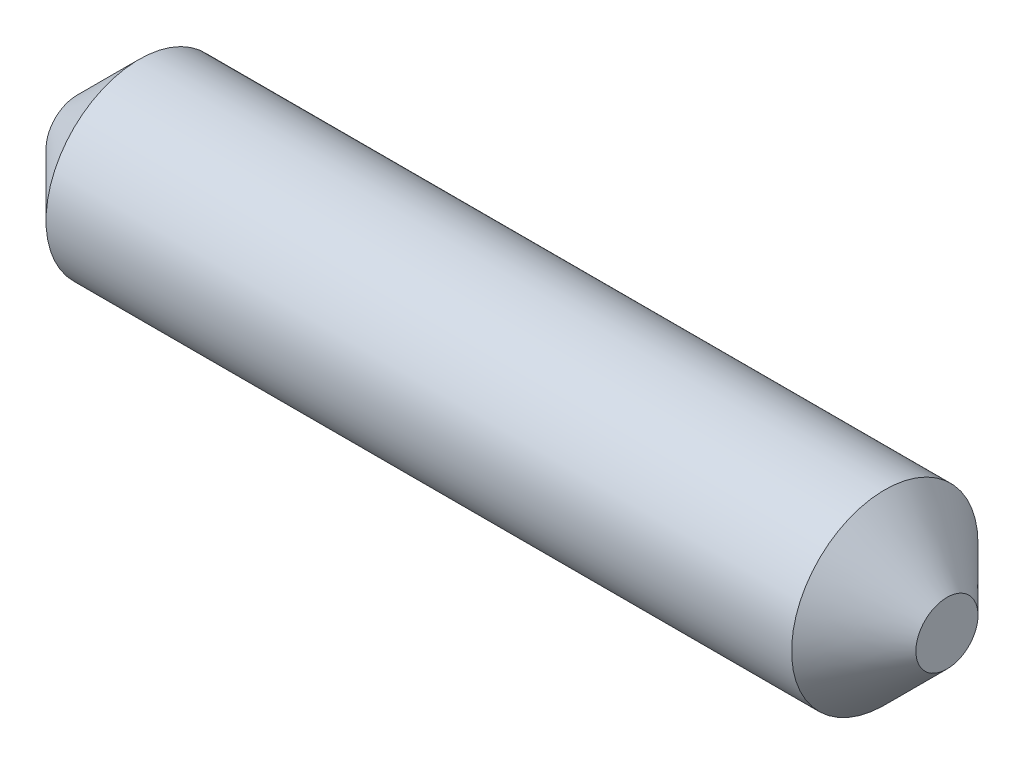
ISO-10303-21;
HEADER;
FILE_DESCRIPTION(('STEP AP214'),'2;1');
FILE_NAME('part.step','',(''),(''),'','','');
FILE_SCHEMA(('AUTOMOTIVE_DESIGN { 1 0 10303 214 1 1 1 1 }'));
ENDSEC;
DATA;
#1=APPLICATION_CONTEXT('core data for automotive mechanical design processes');
#2=APPLICATION_PROTOCOL_DEFINITION('international standard','automotive_design',2000,#1);
#3=PRODUCT_CONTEXT('',#1,'mechanical');
#4=PRODUCT('Part','Part','',(#3));
#5=PRODUCT_RELATED_PRODUCT_CATEGORY('part','',(#4));
#6=PRODUCT_DEFINITION_FORMATION('','',#4);
#7=PRODUCT_DEFINITION_CONTEXT('part definition',#1,'design');
#8=PRODUCT_DEFINITION('design','',#6,#7);
#9=PRODUCT_DEFINITION_SHAPE('','',#8);
#10=(LENGTH_UNIT() NAMED_UNIT(*) SI_UNIT(.MILLI.,.METRE.));
#11=(NAMED_UNIT(*) PLANE_ANGLE_UNIT() SI_UNIT($,.RADIAN.));
#12=(NAMED_UNIT(*) SI_UNIT($,.STERADIAN.) SOLID_ANGLE_UNIT());
#13=UNCERTAINTY_MEASURE_WITH_UNIT(LENGTH_MEASURE(1.E-05),#10,'distance_accuracy_value','');
#14=(GEOMETRIC_REPRESENTATION_CONTEXT(3) GLOBAL_UNCERTAINTY_ASSIGNED_CONTEXT((#13)) GLOBAL_UNIT_ASSIGNED_CONTEXT((#10,
#11,#12)) REPRESENTATION_CONTEXT('',''));
#15=CARTESIAN_POINT('',(0.,0.,0.));
#16=DIRECTION('',(0.,0.,1.));
#17=DIRECTION('',(1.,0.,0.));
#18=AXIS2_PLACEMENT_3D('',#15,#16,#17);
#19=CARTESIAN_POINT('',(7.,0.,0.));
#20=DIRECTION('',(-1.,0.,0.));
#21=DIRECTION('',(0.,0.,1.));
#22=AXIS2_PLACEMENT_3D('',#19,#20,#21);
#23=CYLINDRICAL_SURFACE('',#22,1.5);
#24=CARTESIAN_POINT('',(-6.,0.,0.));
#25=DIRECTION('',(1.,0.,0.));
#26=DIRECTION('',(0.,0.,-1.));
#27=AXIS2_PLACEMENT_3D('',#24,#25,#26);
#28=CIRCLE('',#27,1.5);
#29=CARTESIAN_POINT('',(-6.,0.,-1.5));
#30=VERTEX_POINT('',#29);
#31=EDGE_CURVE('E42',#30,#30,#28,.T.);
#32=ORIENTED_EDGE('',*,*,#31,.T.);
#33=EDGE_LOOP('',(#32));
#34=FACE_BOUND('',#33,.T.);
#35=CARTESIAN_POINT('',(5.99999999999999,0.,0.));
#36=DIRECTION('',(1.,0.,0.));
#37=DIRECTION('',(0.,0.,-1.));
#38=AXIS2_PLACEMENT_3D('',#35,#36,#37);
#39=CIRCLE('',#38,1.5);
#40=CARTESIAN_POINT('',(5.99999999999999,0.,-1.5));
#41=VERTEX_POINT('',#40);
#42=EDGE_CURVE('E46',#41,#41,#39,.F.);
#43=ORIENTED_EDGE('',*,*,#42,.T.);
#44=EDGE_LOOP('',(#43));
#45=FACE_BOUND('',#44,.T.);
#46=ADVANCED_FACE('F31',(#34,#45),#23,.T.);
#47=CARTESIAN_POINT('',(7.,0.,0.));
#48=DIRECTION('',(1.,0.,0.));
#49=DIRECTION('',(0.,0.,-1.));
#50=AXIS2_PLACEMENT_3D('',#47,#48,#49);
#51=PLANE('',#50);
#52=CARTESIAN_POINT('',(7.,0.,0.));
#53=DIRECTION('',(1.,0.,0.));
#54=DIRECTION('',(0.,0.,-1.));
#55=AXIS2_PLACEMENT_3D('',#52,#53,#54);
#56=CIRCLE('',#55,0.499999999999997);
#57=CARTESIAN_POINT('',(7.,0.,-0.499999999999997));
#58=VERTEX_POINT('',#57);
#59=EDGE_CURVE('E10',#58,#58,#56,.T.);
#60=ORIENTED_EDGE('',*,*,#59,.T.);
#61=EDGE_LOOP('',(#60));
#62=FACE_BOUND('',#61,.T.);
#63=ADVANCED_FACE('F62',(#62),#51,.T.);
#64=CARTESIAN_POINT('',(-7.,0.,0.));
#65=DIRECTION('',(1.,0.,0.));
#66=DIRECTION('',(0.,0.,-1.));
#67=AXIS2_PLACEMENT_3D('',#64,#65,#66);
#68=PLANE('',#67);
#69=CARTESIAN_POINT('',(-7.,0.,0.));
#70=DIRECTION('',(1.,0.,0.));
#71=DIRECTION('',(0.,0.,-1.));
#72=AXIS2_PLACEMENT_3D('',#69,#70,#71);
#73=CIRCLE('',#72,0.5);
#74=CARTESIAN_POINT('',(-7.,0.,-0.5));
#75=VERTEX_POINT('',#74);
#76=EDGE_CURVE('E38',#75,#75,#73,.F.);
#77=ORIENTED_EDGE('',*,*,#76,.T.);
#78=EDGE_LOOP('',(#77));
#79=FACE_BOUND('',#78,.T.);
#80=ADVANCED_FACE('F59',(#79),#68,.F.);
#81=CARTESIAN_POINT('',(-6.,0.,0.));
#82=DIRECTION('',(1.,0.,0.));
#83=DIRECTION('',(0.,0.,-1.));
#84=AXIS2_PLACEMENT_3D('',#81,#82,#83);
#85=CONICAL_SURFACE('',#84,1.5,0.78539816339745);
#86=ORIENTED_EDGE('',*,*,#76,.F.);
#87=EDGE_LOOP('',(#86));
#88=FACE_BOUND('',#87,.T.);
#89=ORIENTED_EDGE('',*,*,#31,.F.);
#90=EDGE_LOOP('',(#89));
#91=FACE_BOUND('',#90,.T.);
#92=ADVANCED_FACE('F55',(#88,#91),#85,.T.);
#93=CARTESIAN_POINT('',(7.,0.,0.));
#94=DIRECTION('',(-1.,0.,0.));
#95=DIRECTION('',(0.,0.,1.));
#96=AXIS2_PLACEMENT_3D('',#93,#94,#95);
#97=CONICAL_SURFACE('',#96,0.499999999999997,0.785398163397447);
#98=ORIENTED_EDGE('',*,*,#42,.F.);
#99=EDGE_LOOP('',(#98));
#100=FACE_BOUND('',#99,.T.);
#101=ORIENTED_EDGE('',*,*,#59,.F.);
#102=EDGE_LOOP('',(#101));
#103=FACE_BOUND('',#102,.T.);
#104=ADVANCED_FACE('F33',(#100,#103),#97,.T.);
#105=CLOSED_SHELL('',(#46,#63,#80,#92,#104));
#106=MANIFOLD_SOLID_BREP('B2',#105);
#107=ADVANCED_BREP_SHAPE_REPRESENTATION('',(#18,#106),#14);
#108=SHAPE_DEFINITION_REPRESENTATION(#9,#107);
ENDSEC;
END-ISO-10303-21;
